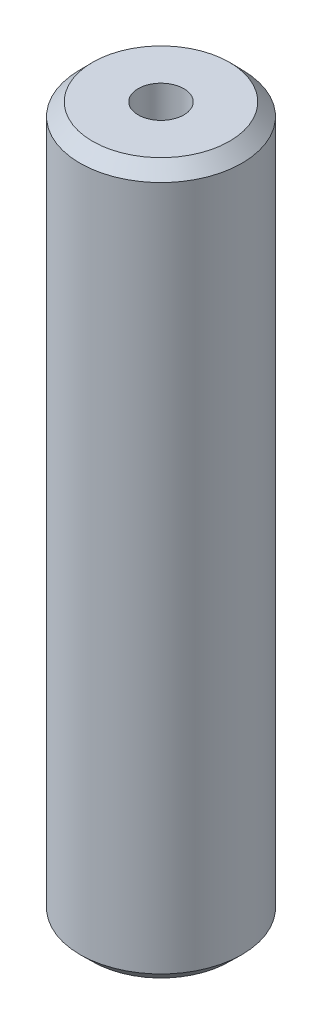
ISO-10303-21;
HEADER;
FILE_DESCRIPTION(('STEP AP214'),'2;1');
FILE_NAME('part.step','',(''),(''),'','','');
FILE_SCHEMA(('AUTOMOTIVE_DESIGN { 1 0 10303 214 1 1 1 1 }'));
ENDSEC;
DATA;
#1=APPLICATION_CONTEXT('core data for automotive mechanical design processes');
#2=APPLICATION_PROTOCOL_DEFINITION('international standard','automotive_design',2000,#1);
#3=PRODUCT_CONTEXT('',#1,'mechanical');
#4=PRODUCT('Part','Part','',(#3));
#5=PRODUCT_RELATED_PRODUCT_CATEGORY('part','',(#4));
#6=PRODUCT_DEFINITION_FORMATION('','',#4);
#7=PRODUCT_DEFINITION_CONTEXT('part definition',#1,'design');
#8=PRODUCT_DEFINITION('design','',#6,#7);
#9=PRODUCT_DEFINITION_SHAPE('','',#8);
#10=(LENGTH_UNIT() NAMED_UNIT(*) SI_UNIT(.MILLI.,.METRE.));
#11=(NAMED_UNIT(*) PLANE_ANGLE_UNIT() SI_UNIT($,.RADIAN.));
#12=(NAMED_UNIT(*) SI_UNIT($,.STERADIAN.) SOLID_ANGLE_UNIT());
#13=UNCERTAINTY_MEASURE_WITH_UNIT(LENGTH_MEASURE(1.E-05),#10,'distance_accuracy_value','');
#14=(GEOMETRIC_REPRESENTATION_CONTEXT(3) GLOBAL_UNCERTAINTY_ASSIGNED_CONTEXT((#13)) GLOBAL_UNIT_ASSIGNED_CONTEXT((#10,
#11,#12)) REPRESENTATION_CONTEXT('',''));
#15=CARTESIAN_POINT('',(0.,0.,0.));
#16=DIRECTION('',(0.,0.,1.));
#17=DIRECTION('',(1.,0.,0.));
#18=AXIS2_PLACEMENT_3D('',#15,#16,#17);
#19=CARTESIAN_POINT('',(0.,43.8844679817414,0.));
#20=DIRECTION('',(0.,-1.,0.));
#21=DIRECTION('',(0.,0.,-1.));
#22=AXIS2_PLACEMENT_3D('',#19,#20,#21);
#23=CYLINDRICAL_SURFACE('',#22,5.);
#24=CARTESIAN_POINT('',(0.,43.0975302593272,0.));
#25=DIRECTION('',(0.,1.,0.));
#26=DIRECTION('',(0.,0.,1.));
#27=AXIS2_PLACEMENT_3D('',#24,#25,#26);
#28=CIRCLE('',#27,5.);
#29=CARTESIAN_POINT('',(0.,43.0975302593272,-5.));
#30=VERTEX_POINT('',#29);
#31=EDGE_CURVE('E50',#30,#30,#28,.F.);
#32=CARTESIAN_POINT('',(0.,0.772836197417331,0.));
#33=DIRECTION('',(0.,1.,0.));
#34=DIRECTION('',(0.,0.,1.));
#35=AXIS2_PLACEMENT_3D('',#32,#33,#34);
#36=CIRCLE('',#35,5.);
#37=CARTESIAN_POINT('',(0.,0.772836197417331,-5.));
#38=VERTEX_POINT('',#37);
#39=EDGE_CURVE('E51',#38,#38,#36,.T.);
#40=CARTESIAN_POINT('',(0.,43.0975302593272,-5.));
#41=CARTESIAN_POINT('',(0.,42.6566480295157,-5.));
#42=CARTESIAN_POINT('',(0.,42.2157657997041,-5.));
#43=CARTESIAN_POINT('',(0.,41.334001340081,-5.));
#44=CARTESIAN_POINT('',(0.,40.8931191102694,-5.));
#45=CARTESIAN_POINT('',(0.,40.0113546506463,-5.));
#46=CARTESIAN_POINT('',(0.,39.5704724208347,-5.));
#47=CARTESIAN_POINT('',(0.,38.6887079612116,-5.));
#48=CARTESIAN_POINT('',(0.,38.2478257314,-5.));
#49=CARTESIAN_POINT('',(0.,37.3660612717769,-5.));
#50=CARTESIAN_POINT('',(0.,36.9251790419654,-5.));
#51=CARTESIAN_POINT('',(0.,36.0434145823422,-5.));
#52=CARTESIAN_POINT('',(0.,35.6025323525307,-5.));
#53=CARTESIAN_POINT('',(0.,34.7207678929076,-5.));
#54=CARTESIAN_POINT('',(0.,34.279885663096,-5.));
#55=CARTESIAN_POINT('',(0.,33.3981212034729,-5.));
#56=CARTESIAN_POINT('',(0.,32.9572389736613,-5.));
#57=CARTESIAN_POINT('',(0.,32.0754745140382,-5.));
#58=CARTESIAN_POINT('',(0.,31.6345922842266,-5.));
#59=CARTESIAN_POINT('',(0.,30.7528278246035,-5.));
#60=CARTESIAN_POINT('',(0.,30.3119455947919,-5.));
#61=CARTESIAN_POINT('',(0.,29.4301811351688,-5.));
#62=CARTESIAN_POINT('',(0.,28.9892989053573,-5.));
#63=CARTESIAN_POINT('',(0.,28.1075344457341,-5.));
#64=CARTESIAN_POINT('',(0.,27.6666522159226,-5.));
#65=CARTESIAN_POINT('',(0.,26.7848877562995,-5.));
#66=CARTESIAN_POINT('',(0.,26.3440055264879,-5.));
#67=CARTESIAN_POINT('',(0.,25.4622410668648,-5.));
#68=CARTESIAN_POINT('',(0.,25.0213588370532,-5.));
#69=CARTESIAN_POINT('',(0.,24.1395943774301,-5.));
#70=CARTESIAN_POINT('',(0.,23.6987121476185,-5.));
#71=CARTESIAN_POINT('',(0.,22.8169476879954,-5.));
#72=CARTESIAN_POINT('',(0.,22.3760654581838,-5.));
#73=CARTESIAN_POINT('',(0.,21.4943009985607,-5.));
#74=CARTESIAN_POINT('',(0.,21.0534187687492,-5.));
#75=CARTESIAN_POINT('',(0.,20.171654309126,-5.));
#76=CARTESIAN_POINT('',(0.,19.7307720793145,-5.));
#77=CARTESIAN_POINT('',(0.,18.8490076196913,-5.));
#78=CARTESIAN_POINT('',(0.,18.4081253898798,-5.));
#79=CARTESIAN_POINT('',(0.,17.5263609302567,-5.));
#80=CARTESIAN_POINT('',(0.,17.0854787004451,-5.));
#81=CARTESIAN_POINT('',(0.,16.203714240822,-5.));
#82=CARTESIAN_POINT('',(0.,15.7628320110104,-5.));
#83=CARTESIAN_POINT('',(0.,14.8810675513873,-5.));
#84=CARTESIAN_POINT('',(0.,14.4401853215757,-5.));
#85=CARTESIAN_POINT('',(0.,13.5584208619526,-5.));
#86=CARTESIAN_POINT('',(0.,13.117538632141,-5.));
#87=CARTESIAN_POINT('',(0.,12.2357741725179,-5.));
#88=CARTESIAN_POINT('',(0.,11.7948919427064,-5.));
#89=CARTESIAN_POINT('',(0.,10.9131274830832,-5.));
#90=CARTESIAN_POINT('',(0.,10.4722452532717,-5.));
#91=CARTESIAN_POINT('',(0.,9.59048079364856,-5.));
#92=CARTESIAN_POINT('',(0.,9.149598563837,-5.));
#93=CARTESIAN_POINT('',(0.,8.26783410421388,-5.));
#94=CARTESIAN_POINT('',(0.,7.82695187440231,-5.));
#95=CARTESIAN_POINT('',(0.,6.94518741477919,-5.));
#96=CARTESIAN_POINT('',(0.,6.50430518496763,-5.));
#97=CARTESIAN_POINT('',(0.,5.6225407253445,-5.));
#98=CARTESIAN_POINT('',(0.,5.18165849553294,-5.));
#99=CARTESIAN_POINT('',(0.,4.29989403590982,-5.));
#100=CARTESIAN_POINT('',(0.,3.85901180609826,-5.));
#101=CARTESIAN_POINT('',(0.,2.97724734647514,-5.));
#102=CARTESIAN_POINT('',(0.,2.53636511666358,-5.));
#103=CARTESIAN_POINT('',(0.,1.65460065704046,-5.));
#104=CARTESIAN_POINT('',(0.,1.21371842722889,-5.));
#105=CARTESIAN_POINT('',(0.,0.772836197417331,-5.));
#106=B_SPLINE_CURVE_WITH_KNOTS('',3,(#40,#41,#42,#43,#44,#45,#46,#47,#48,#49,#50,#51,#52,#53,
#54,#55,#56,#57,#58,#59,#60,#61,#62,#63,#64,#65,#66,#67,#68,#69,#70,#71,#72,#73,#74,#75,#76,#77,
#78,#79,#80,#81,#82,#83,#84,#85,#86,#87,#88,#89,#90,#91,#92,#93,#94,#95,#96,#97,#98,#99,#100,
#101,#102,#103,#104,#105),.UNSPECIFIED.,.F.,.F.,(4,2,2,2,2,2,2,2,2,2,2,2,2,2,2,2,2,2,2,2,2,2,2,
2,2,2,2,2,2,2,2,2,4),(0.,1.32264668943468,2.64529337886937,3.96794006830405,5.29058675773873,
6.61323344717341,7.9358801366081,9.25852682604279,10.5811735154775,11.9038202049122,
13.2264668943468,14.5491135837815,15.8717602732162,17.1944069626509,18.5170536520856,
19.8397003415203,21.1623470309549,22.4849937203896,23.8076404098243,25.130287099259,
26.4529337886937,27.7755804781284,29.098227167563,30.4208738569977,31.7435205464324,
33.0661672358671,34.3888139253018,35.7114606147365,37.0341073041712,38.3567539936058,
39.6794006830405,41.0020473724752,42.3246940619099),.UNSPECIFIED.);
#107=EDGE_CURVE('BSEAM39',#30,#38,#106,.T.);
#108=ORIENTED_EDGE('',*,*,#31,.T.);
#109=ORIENTED_EDGE('',*,*,#39,.T.);
#110=ORIENTED_EDGE('',*,*,#107,.T.);
#111=ORIENTED_EDGE('',*,*,#107,.F.);
#112=EDGE_LOOP('',(#108,#110,#109,#111));
#113=FACE_BOUND('',#112,.T.);
#114=ADVANCED_FACE('F39',(#113),#23,.T.);
#115=CARTESIAN_POINT('',(0.,43.8844679817414,0.));
#116=DIRECTION('',(0.,1.,0.));
#117=DIRECTION('',(0.,0.,1.));
#118=AXIS2_PLACEMENT_3D('',#115,#116,#117);
#119=PLANE('',#118);
#120=CARTESIAN_POINT('',(0.,43.8844679817414,0.));
#121=DIRECTION('',(0.,1.,0.));
#122=DIRECTION('',(0.,0.,1.));
#123=AXIS2_PLACEMENT_3D('',#120,#121,#122);
#124=CIRCLE('',#123,4.22716380258273);
#125=CARTESIAN_POINT('',(0.,43.8844679817414,4.22716380258273));
#126=VERTEX_POINT('',#125);
#127=EDGE_CURVE('E54',#126,#126,#124,.T.);
#128=ORIENTED_EDGE('',*,*,#127,.T.);
#129=EDGE_LOOP('',(#128));
#130=FACE_BOUND('',#129,.T.);
#131=CARTESIAN_POINT('',(0.,43.8844679817414,0.));
#132=DIRECTION('',(0.,1.,0.));
#133=DIRECTION('',(0.,0.,1.));
#134=AXIS2_PLACEMENT_3D('',#131,#132,#133);
#135=CIRCLE('',#134,1.40911016990909);
#136=CARTESIAN_POINT('',(0.,43.8844679817414,-1.40911016990909));
#137=VERTEX_POINT('',#136);
#138=EDGE_CURVE('E58',#137,#137,#135,.T.);
#139=ORIENTED_EDGE('',*,*,#138,.F.);
#140=EDGE_LOOP('',(#139));
#141=FACE_BOUND('',#140,.T.);
#142=ADVANCED_FACE('F69',(#130,#141),#119,.T.);
#143=CARTESIAN_POINT('',(0.,0.,0.));
#144=DIRECTION('',(0.,1.,0.));
#145=DIRECTION('',(0.,0.,1.));
#146=AXIS2_PLACEMENT_3D('',#143,#144,#145);
#147=PLANE('',#146);
#148=CARTESIAN_POINT('',(0.,0.,0.));
#149=DIRECTION('',(0.,1.,0.));
#150=DIRECTION('',(0.,0.,1.));
#151=AXIS2_PLACEMENT_3D('',#148,#149,#150);
#152=CIRCLE('',#151,4.2130622775858);
#153=CARTESIAN_POINT('',(0.,0.,4.2130622775858));
#154=VERTEX_POINT('',#153);
#155=EDGE_CURVE('E10',#154,#154,#152,.F.);
#156=ORIENTED_EDGE('',*,*,#155,.T.);
#157=EDGE_LOOP('',(#156));
#158=FACE_BOUND('',#157,.T.);
#159=CARTESIAN_POINT('',(0.,0.,0.));
#160=DIRECTION('',(0.,1.,0.));
#161=DIRECTION('',(0.,0.,1.));
#162=AXIS2_PLACEMENT_3D('',#159,#160,#161);
#163=CIRCLE('',#162,1.40911016990909);
#164=CARTESIAN_POINT('',(0.,0.,-1.40911016990909));
#165=VERTEX_POINT('',#164);
#166=EDGE_CURVE('E63',#165,#165,#163,.T.);
#167=ORIENTED_EDGE('',*,*,#166,.T.);
#168=EDGE_LOOP('',(#167));
#169=FACE_BOUND('',#168,.T.);
#170=ADVANCED_FACE('F75',(#158,#169),#147,.F.);
#171=CARTESIAN_POINT('',(0.,43.8844679817414,0.));
#172=DIRECTION('',(0.,-1.,0.));
#173=DIRECTION('',(0.,0.,-1.));
#174=AXIS2_PLACEMENT_3D('',#171,#172,#173);
#175=CYLINDRICAL_SURFACE('',#174,1.40911016990909);
#176=CARTESIAN_POINT('',(0.,43.8844679817414,-1.40911016990909));
#177=CARTESIAN_POINT('',(0.,43.4273381069316,-1.40911016990909));
#178=CARTESIAN_POINT('',(0.,42.9702082321218,-1.40911016990909));
#179=CARTESIAN_POINT('',(0.,42.0559484825021,-1.40911016990909));
#180=CARTESIAN_POINT('',(0.,41.5988186076923,-1.40911016990909));
#181=CARTESIAN_POINT('',(0.,40.6845588580727,-1.40911016990909));
#182=CARTESIAN_POINT('',(0.,40.2274289832629,-1.40911016990909));
#183=CARTESIAN_POINT('',(0.,39.3131692336433,-1.40911016990909));
#184=CARTESIAN_POINT('',(0.,38.8560393588335,-1.40911016990909));
#185=CARTESIAN_POINT('',(0.,37.9417796092139,-1.40911016990909));
#186=CARTESIAN_POINT('',(0.,37.4846497344041,-1.40911016990909));
#187=CARTESIAN_POINT('',(0.,36.5703899847845,-1.40911016990909));
#188=CARTESIAN_POINT('',(0.,36.1132601099747,-1.40911016990909));
#189=CARTESIAN_POINT('',(0.,35.1990003603551,-1.40911016990909));
#190=CARTESIAN_POINT('',(0.,34.7418704855452,-1.40911016990909));
#191=CARTESIAN_POINT('',(0.,33.8276107359256,-1.40911016990909));
#192=CARTESIAN_POINT('',(0.,33.3704808611158,-1.40911016990909));
#193=CARTESIAN_POINT('',(0.,32.4562211114962,-1.40911016990909));
#194=CARTESIAN_POINT('',(0.,31.9990912366864,-1.40911016990909));
#195=CARTESIAN_POINT('',(0.,31.0848314870668,-1.40911016990909));
#196=CARTESIAN_POINT('',(0.,30.627701612257,-1.40911016990909));
#197=CARTESIAN_POINT('',(0.,29.7134418626374,-1.40911016990909));
#198=CARTESIAN_POINT('',(0.,29.2563119878276,-1.40911016990909));
#199=CARTESIAN_POINT('',(0.,28.342052238208,-1.40911016990909));
#200=CARTESIAN_POINT('',(0.,27.8849223633982,-1.40911016990909));
#201=CARTESIAN_POINT('',(0.,26.9706626137786,-1.40911016990909));
#202=CARTESIAN_POINT('',(0.,26.5135327389687,-1.40911016990909));
#203=CARTESIAN_POINT('',(0.,25.5992729893491,-1.40911016990909));
#204=CARTESIAN_POINT('',(0.,25.1421431145393,-1.40911016990909));
#205=CARTESIAN_POINT('',(0.,24.2278833649197,-1.40911016990909));
#206=CARTESIAN_POINT('',(0.,23.7707534901099,-1.40911016990909));
#207=CARTESIAN_POINT('',(0.,22.8564937404903,-1.40911016990909));
#208=CARTESIAN_POINT('',(0.,22.3993638656805,-1.40911016990909));
#209=CARTESIAN_POINT('',(0.,21.4851041160609,-1.40911016990909));
#210=CARTESIAN_POINT('',(0.,21.0279742412511,-1.40911016990909));
#211=CARTESIAN_POINT('',(0.,20.1137144916315,-1.40911016990909));
#212=CARTESIAN_POINT('',(0.,19.6565846168217,-1.40911016990909));
#213=CARTESIAN_POINT('',(0.,18.742324867202,-1.40911016990909));
#214=CARTESIAN_POINT('',(0.,18.2851949923922,-1.40911016990909));
#215=CARTESIAN_POINT('',(0.,17.3709352427726,-1.40911016990909));
#216=CARTESIAN_POINT('',(0.,16.9138053679628,-1.40911016990909));
#217=CARTESIAN_POINT('',(0.,15.9995456183432,-1.40911016990909));
#218=CARTESIAN_POINT('',(0.,15.5424157435334,-1.40911016990909));
#219=CARTESIAN_POINT('',(0.,14.6281559939138,-1.40911016990909));
#220=CARTESIAN_POINT('',(0.,14.171026119104,-1.40911016990909));
#221=CARTESIAN_POINT('',(0.,13.2567663694844,-1.40911016990909));
#222=CARTESIAN_POINT('',(0.,12.7996364946746,-1.40911016990909));
#223=CARTESIAN_POINT('',(0.,11.885376745055,-1.40911016990909));
#224=CARTESIAN_POINT('',(0.,11.4282468702452,-1.40911016990909));
#225=CARTESIAN_POINT('',(0.,10.5139871206255,-1.40911016990909));
#226=CARTESIAN_POINT('',(0.,10.0568572458157,-1.40911016990909));
#227=CARTESIAN_POINT('',(0.,9.14259749619612,-1.40911016990909));
#228=CARTESIAN_POINT('',(0.,8.68546762138632,-1.40911016990909));
#229=CARTESIAN_POINT('',(0.,7.77120787176671,-1.40911016990909));
#230=CARTESIAN_POINT('',(0.,7.3140779969569,-1.40911016990909));
#231=CARTESIAN_POINT('',(0.,6.39981824733729,-1.40911016990909));
#232=CARTESIAN_POINT('',(0.,5.94268837252748,-1.40911016990909));
#233=CARTESIAN_POINT('',(0.,5.02842862290787,-1.40911016990909));
#234=CARTESIAN_POINT('',(0.,4.57129874809806,-1.40911016990909));
#235=CARTESIAN_POINT('',(0.,3.65703899847845,-1.40911016990909));
#236=CARTESIAN_POINT('',(0.,3.19990912366864,-1.40911016990909));
#237=CARTESIAN_POINT('',(0.,2.28564937404903,-1.40911016990909));
#238=CARTESIAN_POINT('',(0.,1.82851949923922,-1.40911016990909));
#239=CARTESIAN_POINT('',(0.,0.914259749619612,-1.40911016990909));
#240=CARTESIAN_POINT('',(0.,0.457129874809806,-1.40911016990909));
#241=CARTESIAN_POINT('',(0.,0.,-1.40911016990909));
#242=B_SPLINE_CURVE_WITH_KNOTS('',3,(#176,#177,#178,#179,#180,#181,#182,#183,#184,#185,#186,
#187,#188,#189,#190,#191,#192,#193,#194,#195,#196,#197,#198,#199,#200,#201,#202,#203,#204,#205,
#206,#207,#208,#209,#210,#211,#212,#213,#214,#215,#216,#217,#218,#219,#220,#221,#222,#223,#224,
#225,#226,#227,#228,#229,#230,#231,#232,#233,#234,#235,#236,#237,#238,#239,#240,#241),
.UNSPECIFIED.,.F.,.F.,(4,2,2,2,2,2,2,2,2,2,2,2,2,2,2,2,2,2,2,2,2,2,2,2,2,2,2,2,2,2,2,2,4),(0.,
1.37138962442942,2.74277924885884,4.11416887328826,5.48555849771767,6.85694812214709,
8.22833774657651,9.59972737100593,10.9711169954353,12.3425066198648,13.7138962442942,
15.0852858687236,16.456675493153,17.8280651175824,19.1994547420119,20.5708443664413,
21.9422339908707,23.3136236153001,24.6850132397295,26.0564028641589,27.4277924885884,
28.7991821130178,30.1705717374472,31.5419613618766,32.913350986306,34.2847406107354,
35.6561302351649,37.0275198595943,38.3989094840237,39.7702991084531,41.1416887328825,
42.513078357312,43.8844679817414),.UNSPECIFIED.);
#243=EDGE_CURVE('BSEAM70',#137,#165,#242,.T.);
#244=ORIENTED_EDGE('',*,*,#138,.T.);
#245=ORIENTED_EDGE('',*,*,#166,.F.);
#246=ORIENTED_EDGE('',*,*,#243,.T.);
#247=ORIENTED_EDGE('',*,*,#243,.F.);
#248=EDGE_LOOP('',(#244,#246,#245,#247));
#249=FACE_BOUND('',#248,.T.);
#250=ADVANCED_FACE('F70',(#249),#175,.F.);
#251=CARTESIAN_POINT('',(0.,43.8844679817414,0.));
#252=DIRECTION('',(0.,-1.,0.));
#253=DIRECTION('',(0.,0.,-1.));
#254=AXIS2_PLACEMENT_3D('',#251,#252,#253);
#255=CONICAL_SURFACE('',#254,4.22716380258273,0.776357660386278);
#256=ORIENTED_EDGE('',*,*,#31,.F.);
#257=EDGE_LOOP('',(#256));
#258=FACE_BOUND('',#257,.T.);
#259=ORIENTED_EDGE('',*,*,#127,.F.);
#260=EDGE_LOOP('',(#259));
#261=FACE_BOUND('',#260,.T.);
#262=ADVANCED_FACE('F81',(#258,#261),#255,.T.);
#263=CARTESIAN_POINT('',(0.,0.772836197417325,0.));
#264=DIRECTION('',(0.,1.,0.));
#265=DIRECTION('',(0.,0.,1.));
#266=AXIS2_PLACEMENT_3D('',#263,#264,#265);
#267=CONICAL_SURFACE('',#266,5.,0.794438666408611);
#268=ORIENTED_EDGE('',*,*,#155,.F.);
#269=EDGE_LOOP('',(#268));
#270=FACE_BOUND('',#269,.T.);
#271=ORIENTED_EDGE('',*,*,#39,.F.);
#272=EDGE_LOOP('',(#271));
#273=FACE_BOUND('',#272,.T.);
#274=ADVANCED_FACE('F45',(#270,#273),#267,.T.);
#275=CLOSED_SHELL('',(#114,#142,#170,#250,#262,#274));
#276=MANIFOLD_SOLID_BREP('B2',#275);
#277=ADVANCED_BREP_SHAPE_REPRESENTATION('',(#18,#276),#14);
#278=SHAPE_DEFINITION_REPRESENTATION(#9,#277);
ENDSEC;
END-ISO-10303-21;
